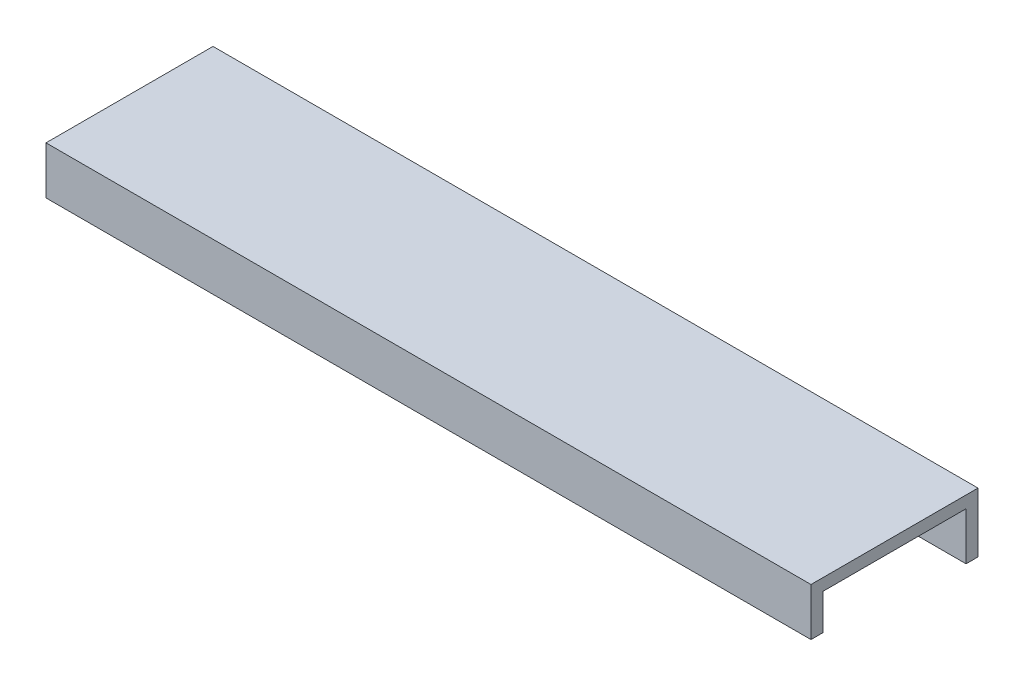
ISO-10303-21;
HEADER;
FILE_DESCRIPTION(('STEP AP214'),'2;1');
FILE_NAME('part.step','',(''),(''),'','','');
FILE_SCHEMA(('AUTOMOTIVE_DESIGN { 1 0 10303 214 1 1 1 1 }'));
ENDSEC;
DATA;
#1=APPLICATION_CONTEXT('core data for automotive mechanical design processes');
#2=APPLICATION_PROTOCOL_DEFINITION('international standard','automotive_design',2000,#1);
#3=PRODUCT_CONTEXT('',#1,'mechanical');
#4=PRODUCT('Part','Part','',(#3));
#5=PRODUCT_RELATED_PRODUCT_CATEGORY('part','',(#4));
#6=PRODUCT_DEFINITION_FORMATION('','',#4);
#7=PRODUCT_DEFINITION_CONTEXT('part definition',#1,'design');
#8=PRODUCT_DEFINITION('design','',#6,#7);
#9=PRODUCT_DEFINITION_SHAPE('','',#8);
#10=(LENGTH_UNIT() NAMED_UNIT(*) SI_UNIT(.MILLI.,.METRE.));
#11=(NAMED_UNIT(*) PLANE_ANGLE_UNIT() SI_UNIT($,.RADIAN.));
#12=(NAMED_UNIT(*) SI_UNIT($,.STERADIAN.) SOLID_ANGLE_UNIT());
#13=UNCERTAINTY_MEASURE_WITH_UNIT(LENGTH_MEASURE(1.E-05),#10,'distance_accuracy_value','');
#14=(GEOMETRIC_REPRESENTATION_CONTEXT(3) GLOBAL_UNCERTAINTY_ASSIGNED_CONTEXT((#13)) GLOBAL_UNIT_ASSIGNED_CONTEXT((#10,
#11,#12)) REPRESENTATION_CONTEXT('',''));
#15=CARTESIAN_POINT('',(0.,0.,0.));
#16=DIRECTION('',(0.,0.,1.));
#17=DIRECTION('',(1.,0.,0.));
#18=AXIS2_PLACEMENT_3D('',#15,#16,#17);
#19=CARTESIAN_POINT('',(-0.00400884014756965,129.040016288812,2.));
#20=DIRECTION('',(0.,-1.,0.));
#21=DIRECTION('',(1.,0.,0.));
#22=AXIS2_PLACEMENT_3D('',#19,#20,#21);
#23=PLANE('',#22);
#24=DIRECTION('',(-1.,0.,0.));
#25=VECTOR('',#24,1.);
#26=CARTESIAN_POINT('',(-0.00400884014756965,129.040016288812,0.));
#27=LINE('',#26,#25);
#28=CARTESIAN_POINT('',(-0.00400884014756965,129.040016288812,0.));
#29=VERTEX_POINT('',#28);
#30=CARTESIAN_POINT('',(-128.250066780148,129.040016288812,0.));
#31=VERTEX_POINT('',#30);
#32=EDGE_CURVE('E101',#29,#31,#27,.T.);
#33=ORIENTED_EDGE('',*,*,#32,.T.);
#34=DIRECTION('',(0.,0.,-1.));
#35=VECTOR('',#34,1.);
#36=CARTESIAN_POINT('',(-128.250066780148,129.040016288812,2.));
#37=LINE('',#36,#35);
#38=CARTESIAN_POINT('',(-128.250066780148,129.040016288812,28.));
#39=VERTEX_POINT('',#38);
#40=EDGE_CURVE('E11',#39,#31,#37,.T.);
#41=ORIENTED_EDGE('',*,*,#40,.F.);
#42=DIRECTION('',(-1.,0.,0.));
#43=VECTOR('',#42,1.);
#44=CARTESIAN_POINT('',(-0.00400884014756965,129.040016288812,28.));
#45=LINE('',#44,#43);
#46=CARTESIAN_POINT('',(-0.00400884014756965,129.040016288812,28.));
#47=VERTEX_POINT('',#46);
#48=EDGE_CURVE('E103',#47,#39,#45,.T.);
#49=ORIENTED_EDGE('',*,*,#48,.F.);
#50=DIRECTION('',(0.,0.,-1.));
#51=VECTOR('',#50,1.);
#52=CARTESIAN_POINT('',(-0.00400884014756965,129.040016288812,2.));
#53=LINE('',#52,#51);
#54=EDGE_CURVE('E88',#47,#29,#53,.T.);
#55=ORIENTED_EDGE('',*,*,#54,.T.);
#56=EDGE_LOOP('',(#33,#41,#49,#55));
#57=FACE_BOUND('',#56,.T.);
#58=ADVANCED_FACE('F43',(#57),#23,.F.);
#59=CARTESIAN_POINT('',(-128.250066780148,129.040016288812,2.));
#60=DIRECTION('',(1.,0.,0.));
#61=DIRECTION('',(0.,0.,-1.));
#62=AXIS2_PLACEMENT_3D('',#59,#60,#61);
#63=PLANE('',#62);
#64=DIRECTION('',(0.,-1.,0.));
#65=VECTOR('',#64,1.);
#66=CARTESIAN_POINT('',(-128.250066780148,129.040016288812,0.));
#67=LINE('',#66,#65);
#68=CARTESIAN_POINT('',(-128.250066780148,119.040016288812,0.));
#69=VERTEX_POINT('',#68);
#70=EDGE_CURVE('E108',#31,#69,#67,.T.);
#71=ORIENTED_EDGE('',*,*,#70,.T.);
#72=DIRECTION('',(0.,0.,-1.));
#73=VECTOR('',#72,1.);
#74=CARTESIAN_POINT('',(-128.250066780148,119.040016288812,2.));
#75=LINE('',#74,#73);
#76=CARTESIAN_POINT('',(-128.250066780148,119.040016288812,2.));
#77=VERTEX_POINT('',#76);
#78=EDGE_CURVE('E50',#77,#69,#75,.T.);
#79=ORIENTED_EDGE('',*,*,#78,.F.);
#80=DIRECTION('',(0.,-1.,0.));
#81=VECTOR('',#80,1.);
#82=CARTESIAN_POINT('',(-128.250066780148,129.040016288812,2.));
#83=LINE('',#82,#81);
#84=CARTESIAN_POINT('',(-128.250066780148,127.040016288809,2.));
#85=VERTEX_POINT('',#84);
#86=EDGE_CURVE('E95',#85,#77,#83,.T.);
#87=ORIENTED_EDGE('',*,*,#86,.F.);
#88=DIRECTION('',(0.,0.,-1.));
#89=VECTOR('',#88,1.);
#90=CARTESIAN_POINT('',(-128.250066780148,127.040016288809,26.));
#91=LINE('',#90,#89);
#92=CARTESIAN_POINT('',(-128.250066780148,127.040016288809,26.));
#93=VERTEX_POINT('',#92);
#94=EDGE_CURVE('E109',#93,#85,#91,.T.);
#95=ORIENTED_EDGE('',*,*,#94,.F.);
#96=DIRECTION('',(0.,-1.,0.));
#97=VECTOR('',#96,1.);
#98=CARTESIAN_POINT('',(-128.250066780148,129.040016288812,26.));
#99=LINE('',#98,#97);
#100=CARTESIAN_POINT('',(-128.250066780148,121.040016288812,26.));
#101=VERTEX_POINT('',#100);
#102=EDGE_CURVE('E148',#93,#101,#99,.T.);
#103=ORIENTED_EDGE('',*,*,#102,.T.);
#104=DIRECTION('',(0.,0.,-1.));
#105=VECTOR('',#104,1.);
#106=CARTESIAN_POINT('',(-128.250066780148,121.040016288812,28.));
#107=LINE('',#106,#105);
#108=CARTESIAN_POINT('',(-128.250066780148,121.040016288812,28.));
#109=VERTEX_POINT('',#108);
#110=EDGE_CURVE('E155',#109,#101,#107,.T.);
#111=ORIENTED_EDGE('',*,*,#110,.F.);
#112=DIRECTION('',(0.,-1.,0.));
#113=VECTOR('',#112,1.);
#114=CARTESIAN_POINT('',(-128.250066780148,129.040016288812,28.));
#115=LINE('',#114,#113);
#116=EDGE_CURVE('E130',#39,#109,#115,.T.);
#117=ORIENTED_EDGE('',*,*,#116,.F.);
#118=ORIENTED_EDGE('',*,*,#40,.T.);
#119=EDGE_LOOP('',(#71,#79,#87,#95,#103,#111,#117,#118));
#120=FACE_BOUND('',#119,.T.);
#121=ADVANCED_FACE('F124',(#120),#63,.F.);
#122=CARTESIAN_POINT('',(-0.00400884014756827,119.040016288812,2.));
#123=DIRECTION('',(0.,1.,0.));
#124=DIRECTION('',(0.,0.,1.));
#125=AXIS2_PLACEMENT_3D('',#122,#123,#124);
#126=PLANE('',#125);
#127=DIRECTION('',(1.,0.,0.));
#128=VECTOR('',#127,1.);
#129=CARTESIAN_POINT('',(-0.00400884014756827,119.040016288812,0.));
#130=LINE('',#129,#128);
#131=CARTESIAN_POINT('',(-0.00400884014756827,119.040016288812,0.));
#132=VERTEX_POINT('',#131);
#133=EDGE_CURVE('E96',#69,#132,#130,.T.);
#134=ORIENTED_EDGE('',*,*,#133,.T.);
#135=DIRECTION('',(0.,0.,-1.));
#136=VECTOR('',#135,1.);
#137=CARTESIAN_POINT('',(-0.00400884014756827,119.040016288812,2.));
#138=LINE('',#137,#136);
#139=CARTESIAN_POINT('',(-0.00400884014756827,119.040016288812,2.));
#140=VERTEX_POINT('',#139);
#141=EDGE_CURVE('E91',#140,#132,#138,.T.);
#142=ORIENTED_EDGE('',*,*,#141,.F.);
#143=DIRECTION('',(1.,0.,0.));
#144=VECTOR('',#143,1.);
#145=CARTESIAN_POINT('',(-0.00400884014756827,119.040016288812,2.));
#146=LINE('',#145,#144);
#147=EDGE_CURVE('E63',#77,#140,#146,.T.);
#148=ORIENTED_EDGE('',*,*,#147,.F.);
#149=ORIENTED_EDGE('',*,*,#78,.T.);
#150=EDGE_LOOP('',(#134,#142,#148,#149));
#151=FACE_BOUND('',#150,.T.);
#152=ADVANCED_FACE('F122',(#151),#126,.F.);
#153=CARTESIAN_POINT('',(-0.00400884014756965,129.040016288812,2.));
#154=DIRECTION('',(-1.,0.,0.));
#155=DIRECTION('',(0.,-1.,0.));
#156=AXIS2_PLACEMENT_3D('',#153,#154,#155);
#157=PLANE('',#156);
#158=DIRECTION('',(0.,1.,0.));
#159=VECTOR('',#158,1.);
#160=CARTESIAN_POINT('',(-0.00400884014756965,129.040016288812,0.));
#161=LINE('',#160,#159);
#162=EDGE_CURVE('E83',#132,#29,#161,.T.);
#163=ORIENTED_EDGE('',*,*,#162,.T.);
#164=ORIENTED_EDGE('',*,*,#54,.F.);
#165=DIRECTION('',(0.,1.,0.));
#166=VECTOR('',#165,1.);
#167=CARTESIAN_POINT('',(-0.00400884014756548,121.040016288812,28.));
#168=LINE('',#167,#166);
#169=CARTESIAN_POINT('',(-0.00400884014756548,121.040016288812,28.));
#170=VERTEX_POINT('',#169);
#171=EDGE_CURVE('E136',#170,#47,#168,.T.);
#172=ORIENTED_EDGE('',*,*,#171,.F.);
#173=DIRECTION('',(0.,0.,-1.));
#174=VECTOR('',#173,1.);
#175=CARTESIAN_POINT('',(-0.00400884014756548,121.040016288812,28.));
#176=LINE('',#175,#174);
#177=CARTESIAN_POINT('',(-0.00400884014756548,121.040016288812,26.));
#178=VERTEX_POINT('',#177);
#179=EDGE_CURVE('E144',#170,#178,#176,.T.);
#180=ORIENTED_EDGE('',*,*,#179,.T.);
#181=DIRECTION('',(0.,1.,0.));
#182=VECTOR('',#181,1.);
#183=CARTESIAN_POINT('',(-0.00400884014756548,121.040016288812,26.));
#184=LINE('',#183,#182);
#185=CARTESIAN_POINT('',(-0.00400884014756861,127.040016288809,26.));
#186=VERTEX_POINT('',#185);
#187=EDGE_CURVE('E145',#178,#186,#184,.T.);
#188=ORIENTED_EDGE('',*,*,#187,.T.);
#189=DIRECTION('',(0.,0.,-1.));
#190=VECTOR('',#189,1.);
#191=CARTESIAN_POINT('',(-0.00400884014756937,127.040016288809,26.));
#192=LINE('',#191,#190);
#193=CARTESIAN_POINT('',(-0.00400884014756937,127.040016288809,2.));
#194=VERTEX_POINT('',#193);
#195=EDGE_CURVE('E113',#186,#194,#192,.T.);
#196=ORIENTED_EDGE('',*,*,#195,.T.);
#197=DIRECTION('',(0.,1.,0.));
#198=VECTOR('',#197,1.);
#199=CARTESIAN_POINT('',(-0.00400884014756965,129.040016288812,2.));
#200=LINE('',#199,#198);
#201=EDGE_CURVE('E105',#140,#194,#200,.T.);
#202=ORIENTED_EDGE('',*,*,#201,.F.);
#203=ORIENTED_EDGE('',*,*,#141,.T.);
#204=EDGE_LOOP('',(#163,#164,#172,#180,#188,#196,#202,#203));
#205=FACE_BOUND('',#204,.T.);
#206=ADVANCED_FACE('F85',(#205),#157,.F.);
#207=CARTESIAN_POINT('',(0.,0.,2.));
#208=DIRECTION('',(0.,0.,1.));
#209=DIRECTION('',(1.,0.,0.));
#210=AXIS2_PLACEMENT_3D('',#207,#208,#209);
#211=PLANE('',#210);
#212=DIRECTION('',(1.,0.,0.));
#213=VECTOR('',#212,1.);
#214=CARTESIAN_POINT('',(0.,127.040016288809,2.));
#215=LINE('',#214,#213);
#216=EDGE_CURVE('E57',#85,#194,#215,.T.);
#217=ORIENTED_EDGE('',*,*,#216,.F.);
#218=ORIENTED_EDGE('',*,*,#86,.T.);
#219=ORIENTED_EDGE('',*,*,#147,.T.);
#220=ORIENTED_EDGE('',*,*,#201,.T.);
#221=EDGE_LOOP('',(#217,#218,#219,#220));
#222=FACE_BOUND('',#221,.T.);
#223=ADVANCED_FACE('F165',(#222),#211,.T.);
#224=CARTESIAN_POINT('',(0.,0.,0.));
#225=DIRECTION('',(0.,0.,1.));
#226=DIRECTION('',(1.,0.,0.));
#227=AXIS2_PLACEMENT_3D('',#224,#225,#226);
#228=PLANE('',#227);
#229=ORIENTED_EDGE('',*,*,#32,.F.);
#230=ORIENTED_EDGE('',*,*,#162,.F.);
#231=ORIENTED_EDGE('',*,*,#133,.F.);
#232=ORIENTED_EDGE('',*,*,#70,.F.);
#233=EDGE_LOOP('',(#229,#230,#231,#232));
#234=FACE_BOUND('',#233,.T.);
#235=ADVANCED_FACE('F107',(#234),#228,.F.);
#236=CARTESIAN_POINT('',(0.,127.040016288809,26.));
#237=DIRECTION('',(0.,1.,0.));
#238=DIRECTION('',(0.,0.,1.));
#239=AXIS2_PLACEMENT_3D('',#236,#237,#238);
#240=PLANE('',#239);
#241=ORIENTED_EDGE('',*,*,#216,.T.);
#242=ORIENTED_EDGE('',*,*,#195,.F.);
#243=DIRECTION('',(1.,0.,0.));
#244=VECTOR('',#243,1.);
#245=CARTESIAN_POINT('',(0.,127.040016288809,26.));
#246=LINE('',#245,#244);
#247=EDGE_CURVE('E158',#93,#186,#246,.T.);
#248=ORIENTED_EDGE('',*,*,#247,.F.);
#249=ORIENTED_EDGE('',*,*,#94,.T.);
#250=EDGE_LOOP('',(#241,#242,#248,#249));
#251=FACE_BOUND('',#250,.T.);
#252=ADVANCED_FACE('F169',(#251),#240,.F.);
#253=CARTESIAN_POINT('',(0.,0.,26.));
#254=DIRECTION('',(0.,0.,1.));
#255=DIRECTION('',(1.,0.,0.));
#256=AXIS2_PLACEMENT_3D('',#253,#254,#255);
#257=PLANE('',#256);
#258=ORIENTED_EDGE('',*,*,#102,.F.);
#259=ORIENTED_EDGE('',*,*,#247,.T.);
#260=ORIENTED_EDGE('',*,*,#187,.F.);
#261=DIRECTION('',(1.,0.,0.));
#262=VECTOR('',#261,1.);
#263=CARTESIAN_POINT('',(-128.250066780148,121.040016288812,26.));
#264=LINE('',#263,#262);
#265=EDGE_CURVE('E140',#101,#178,#264,.T.);
#266=ORIENTED_EDGE('',*,*,#265,.F.);
#267=EDGE_LOOP('',(#258,#259,#260,#266));
#268=FACE_BOUND('',#267,.T.);
#269=ADVANCED_FACE('F179',(#268),#257,.F.);
#270=CARTESIAN_POINT('',(-128.250066780148,121.040016288812,28.));
#271=DIRECTION('',(0.,1.,0.));
#272=DIRECTION('',(0.,0.,1.));
#273=AXIS2_PLACEMENT_3D('',#270,#271,#272);
#274=PLANE('',#273);
#275=ORIENTED_EDGE('',*,*,#265,.T.);
#276=ORIENTED_EDGE('',*,*,#179,.F.);
#277=DIRECTION('',(1.,0.,0.));
#278=VECTOR('',#277,1.);
#279=CARTESIAN_POINT('',(-128.250066780148,121.040016288812,28.));
#280=LINE('',#279,#278);
#281=EDGE_CURVE('E138',#109,#170,#280,.T.);
#282=ORIENTED_EDGE('',*,*,#281,.F.);
#283=ORIENTED_EDGE('',*,*,#110,.T.);
#284=EDGE_LOOP('',(#275,#276,#282,#283));
#285=FACE_BOUND('',#284,.T.);
#286=ADVANCED_FACE('F188',(#285),#274,.F.);
#287=CARTESIAN_POINT('',(0.,0.,28.));
#288=DIRECTION('',(0.,0.,1.));
#289=DIRECTION('',(1.,0.,0.));
#290=AXIS2_PLACEMENT_3D('',#287,#288,#289);
#291=PLANE('',#290);
#292=ORIENTED_EDGE('',*,*,#171,.T.);
#293=ORIENTED_EDGE('',*,*,#48,.T.);
#294=ORIENTED_EDGE('',*,*,#116,.T.);
#295=ORIENTED_EDGE('',*,*,#281,.T.);
#296=EDGE_LOOP('',(#292,#293,#294,#295));
#297=FACE_BOUND('',#296,.T.);
#298=ADVANCED_FACE('F134',(#297),#291,.T.);
#299=CLOSED_SHELL('',(#58,#121,#152,#206,#223,#235,#252,#269,#286,#298));
#300=MANIFOLD_SOLID_BREP('B2',#299);
#301=ADVANCED_BREP_SHAPE_REPRESENTATION('',(#18,#300),#14);
#302=SHAPE_DEFINITION_REPRESENTATION(#9,#301);
ENDSEC;
END-ISO-10303-21;
